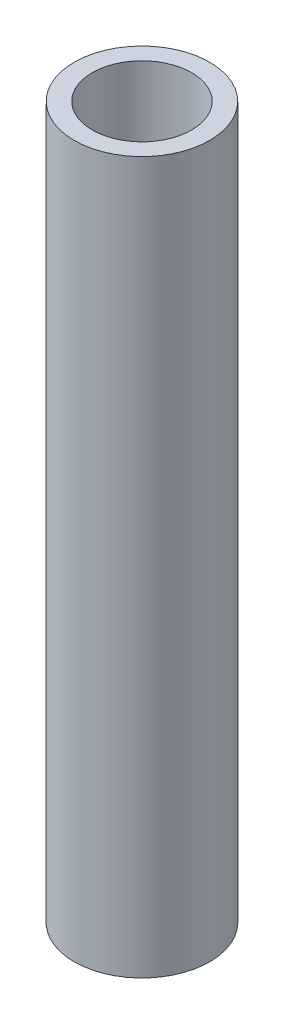
ISO-10303-21;
HEADER;
FILE_DESCRIPTION(('STEP AP214'),'2;1');
FILE_NAME('part.step','',(''),(''),'','','');
FILE_SCHEMA(('AUTOMOTIVE_DESIGN { 1 0 10303 214 1 1 1 1 }'));
ENDSEC;
DATA;
#1=APPLICATION_CONTEXT('core data for automotive mechanical design processes');
#2=APPLICATION_PROTOCOL_DEFINITION('international standard','automotive_design',2000,#1);
#3=PRODUCT_CONTEXT('',#1,'mechanical');
#4=PRODUCT('Part','Part','',(#3));
#5=PRODUCT_RELATED_PRODUCT_CATEGORY('part','',(#4));
#6=PRODUCT_DEFINITION_FORMATION('','',#4);
#7=PRODUCT_DEFINITION_CONTEXT('part definition',#1,'design');
#8=PRODUCT_DEFINITION('design','',#6,#7);
#9=PRODUCT_DEFINITION_SHAPE('','',#8);
#10=(LENGTH_UNIT() NAMED_UNIT(*) SI_UNIT(.MILLI.,.METRE.));
#11=(NAMED_UNIT(*) PLANE_ANGLE_UNIT() SI_UNIT($,.RADIAN.));
#12=(NAMED_UNIT(*) SI_UNIT($,.STERADIAN.) SOLID_ANGLE_UNIT());
#13=UNCERTAINTY_MEASURE_WITH_UNIT(LENGTH_MEASURE(1.E-05),#10,'distance_accuracy_value','');
#14=(GEOMETRIC_REPRESENTATION_CONTEXT(3) GLOBAL_UNCERTAINTY_ASSIGNED_CONTEXT((#13)) GLOBAL_UNIT_ASSIGNED_CONTEXT((#10,
#11,#12)) REPRESENTATION_CONTEXT('',''));
#15=CARTESIAN_POINT('',(0.,0.,0.));
#16=DIRECTION('',(0.,0.,1.));
#17=DIRECTION('',(1.,0.,0.));
#18=AXIS2_PLACEMENT_3D('',#15,#16,#17);
#19=CARTESIAN_POINT('',(0.,157.5,0.));
#20=DIRECTION('',(0.,1.,0.));
#21=DIRECTION('',(0.,0.,1.));
#22=AXIS2_PLACEMENT_3D('',#19,#20,#21);
#23=PLANE('',#22);
#24=CARTESIAN_POINT('',(0.,157.5,0.));
#25=DIRECTION('',(0.,1.,0.));
#26=DIRECTION('',(0.,0.,1.));
#27=AXIS2_PLACEMENT_3D('',#24,#25,#26);
#28=CIRCLE('',#27,15.);
#29=CARTESIAN_POINT('',(0.,157.5,15.));
#30=VERTEX_POINT('',#29);
#31=EDGE_CURVE('E10',#30,#30,#28,.T.);
#32=ORIENTED_EDGE('',*,*,#31,.T.);
#33=EDGE_LOOP('',(#32));
#34=FACE_BOUND('',#33,.T.);
#35=CARTESIAN_POINT('',(0.,157.5,0.));
#36=DIRECTION('',(0.,1.,0.));
#37=DIRECTION('',(0.,0.,1.));
#38=AXIS2_PLACEMENT_3D('',#35,#36,#37);
#39=CIRCLE('',#38,11.);
#40=CARTESIAN_POINT('',(0.,157.5,11.));
#41=VERTEX_POINT('',#40);
#42=EDGE_CURVE('E51',#41,#41,#39,.T.);
#43=ORIENTED_EDGE('',*,*,#42,.F.);
#44=EDGE_LOOP('',(#43));
#45=FACE_BOUND('',#44,.T.);
#46=ADVANCED_FACE('F40',(#34,#45),#23,.T.);
#47=CARTESIAN_POINT('',(0.,0.,0.));
#48=DIRECTION('',(0.,1.,0.));
#49=DIRECTION('',(0.,0.,1.));
#50=AXIS2_PLACEMENT_3D('',#47,#48,#49);
#51=PLANE('',#50);
#52=CARTESIAN_POINT('',(0.,0.,0.));
#53=DIRECTION('',(0.,1.,0.));
#54=DIRECTION('',(0.,0.,1.));
#55=AXIS2_PLACEMENT_3D('',#52,#53,#54);
#56=CIRCLE('',#55,15.);
#57=CARTESIAN_POINT('',(0.,0.,15.));
#58=VERTEX_POINT('',#57);
#59=EDGE_CURVE('E44',#58,#58,#56,.T.);
#60=ORIENTED_EDGE('',*,*,#59,.F.);
#61=EDGE_LOOP('',(#60));
#62=FACE_BOUND('',#61,.T.);
#63=CARTESIAN_POINT('',(0.,0.,0.));
#64=DIRECTION('',(0.,1.,0.));
#65=DIRECTION('',(0.,0.,1.));
#66=AXIS2_PLACEMENT_3D('',#63,#64,#65);
#67=CIRCLE('',#66,11.);
#68=CARTESIAN_POINT('',(0.,0.,11.));
#69=VERTEX_POINT('',#68);
#70=EDGE_CURVE('E53',#69,#69,#67,.T.);
#71=ORIENTED_EDGE('',*,*,#70,.T.);
#72=EDGE_LOOP('',(#71));
#73=FACE_BOUND('',#72,.T.);
#74=ADVANCED_FACE('F63',(#62,#73),#51,.F.);
#75=CARTESIAN_POINT('',(0.,157.5,0.));
#76=DIRECTION('',(0.,-1.,0.));
#77=DIRECTION('',(0.,0.,-1.));
#78=AXIS2_PLACEMENT_3D('',#75,#76,#77);
#79=CYLINDRICAL_SURFACE('',#78,15.);
#80=ORIENTED_EDGE('',*,*,#31,.F.);
#81=EDGE_LOOP('',(#80));
#82=FACE_BOUND('',#81,.T.);
#83=ORIENTED_EDGE('',*,*,#59,.T.);
#84=EDGE_LOOP('',(#83));
#85=FACE_BOUND('',#84,.T.);
#86=ADVANCED_FACE('F42',(#82,#85),#79,.T.);
#87=CARTESIAN_POINT('',(0.,157.5,0.));
#88=DIRECTION('',(0.,-1.,0.));
#89=DIRECTION('',(0.,0.,-1.));
#90=AXIS2_PLACEMENT_3D('',#87,#88,#89);
#91=CYLINDRICAL_SURFACE('',#90,11.);
#92=ORIENTED_EDGE('',*,*,#42,.T.);
#93=EDGE_LOOP('',(#92));
#94=FACE_BOUND('',#93,.T.);
#95=ORIENTED_EDGE('',*,*,#70,.F.);
#96=EDGE_LOOP('',(#95));
#97=FACE_BOUND('',#96,.T.);
#98=ADVANCED_FACE('F59',(#94,#97),#91,.F.);
#99=CLOSED_SHELL('',(#46,#74,#86,#98));
#100=MANIFOLD_SOLID_BREP('B2',#99);
#101=ADVANCED_BREP_SHAPE_REPRESENTATION('',(#18,#100),#14);
#102=SHAPE_DEFINITION_REPRESENTATION(#9,#101);
ENDSEC;
END-ISO-10303-21;
